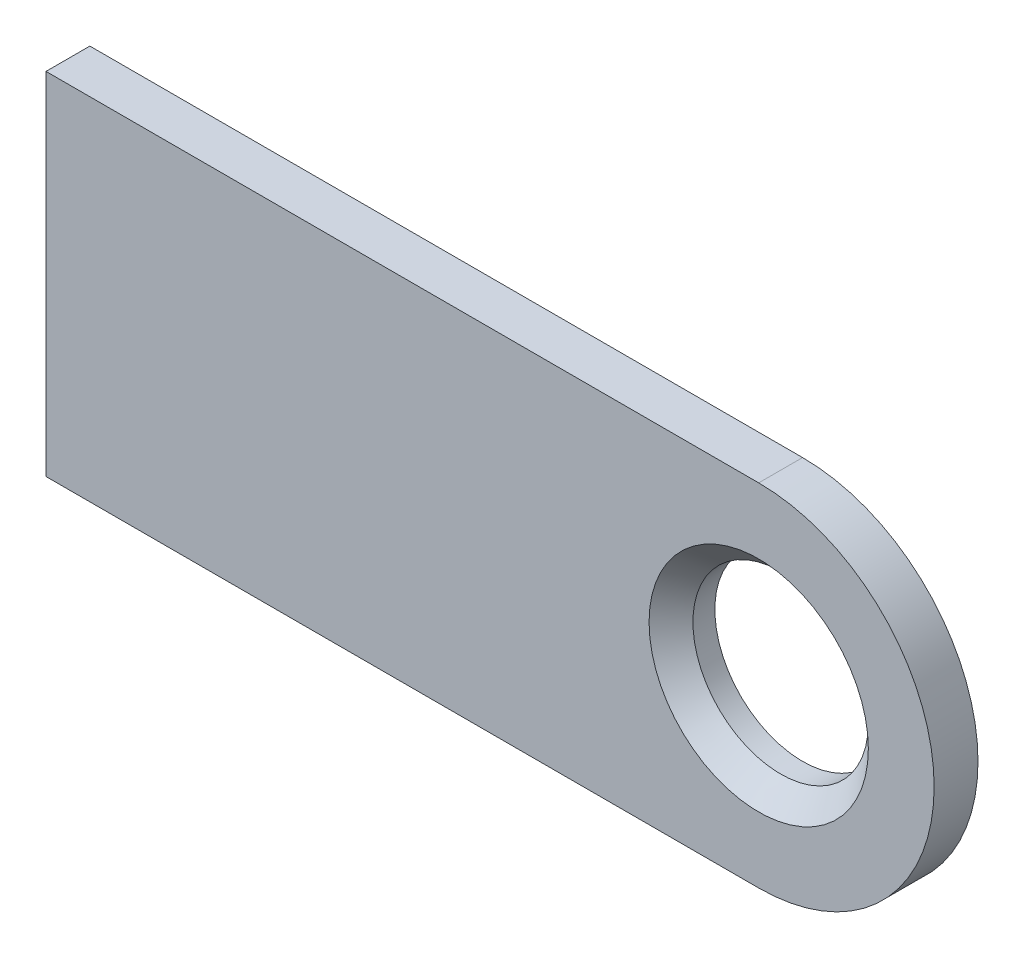
ISO-10303-21;
HEADER;
FILE_DESCRIPTION(('STEP AP214'),'2;1');
FILE_NAME('part.step','',(''),(''),'','','');
FILE_SCHEMA(('AUTOMOTIVE_DESIGN { 1 0 10303 214 1 1 1 1 }'));
ENDSEC;
DATA;
#1=APPLICATION_CONTEXT('core data for automotive mechanical design processes');
#2=APPLICATION_PROTOCOL_DEFINITION('international standard','automotive_design',2000,#1);
#3=PRODUCT_CONTEXT('',#1,'mechanical');
#4=PRODUCT('Part','Part','',(#3));
#5=PRODUCT_RELATED_PRODUCT_CATEGORY('part','',(#4));
#6=PRODUCT_DEFINITION_FORMATION('','',#4);
#7=PRODUCT_DEFINITION_CONTEXT('part definition',#1,'design');
#8=PRODUCT_DEFINITION('design','',#6,#7);
#9=PRODUCT_DEFINITION_SHAPE('','',#8);
#10=(LENGTH_UNIT() NAMED_UNIT(*) SI_UNIT(.MILLI.,.METRE.));
#11=(NAMED_UNIT(*) PLANE_ANGLE_UNIT() SI_UNIT($,.RADIAN.));
#12=(NAMED_UNIT(*) SI_UNIT($,.STERADIAN.) SOLID_ANGLE_UNIT());
#13=UNCERTAINTY_MEASURE_WITH_UNIT(LENGTH_MEASURE(1.E-05),#10,'distance_accuracy_value','');
#14=(GEOMETRIC_REPRESENTATION_CONTEXT(3) GLOBAL_UNCERTAINTY_ASSIGNED_CONTEXT((#13)) GLOBAL_UNIT_ASSIGNED_CONTEXT((#10,
#11,#12)) REPRESENTATION_CONTEXT('',''));
#15=CARTESIAN_POINT('',(0.,0.,0.));
#16=DIRECTION('',(0.,0.,1.));
#17=DIRECTION('',(1.,0.,0.));
#18=AXIS2_PLACEMENT_3D('',#15,#16,#17);
#19=CARTESIAN_POINT('',(0.,0.,4.));
#20=DIRECTION('',(0.,0.,1.));
#21=DIRECTION('',(1.,0.,0.));
#22=AXIS2_PLACEMENT_3D('',#19,#20,#21);
#23=PLANE('',#22);
#24=CARTESIAN_POINT('',(0.,0.,4.));
#25=DIRECTION('',(0.,0.,1.));
#26=DIRECTION('',(1.,0.,0.));
#27=AXIS2_PLACEMENT_3D('',#24,#25,#26);
#28=CIRCLE('',#27,10.);
#29=CARTESIAN_POINT('',(10.,0.,4.));
#30=VERTEX_POINT('',#29);
#31=EDGE_CURVE('E11',#30,#30,#28,.F.);
#32=ORIENTED_EDGE('',*,*,#31,.T.);
#33=EDGE_LOOP('',(#32));
#34=FACE_BOUND('',#33,.T.);
#35=CARTESIAN_POINT('',(0.,0.,4.));
#36=DIRECTION('',(0.,0.,1.));
#37=DIRECTION('',(1.,0.,0.));
#38=AXIS2_PLACEMENT_3D('',#35,#36,#37);
#39=CIRCLE('',#38,16.0000000000001);
#40=CARTESIAN_POINT('',(0.,-16.0000000000003,4.));
#41=VERTEX_POINT('',#40);
#42=CARTESIAN_POINT('',(0.,16.,4.));
#43=VERTEX_POINT('',#42);
#44=EDGE_CURVE('E92',#41,#43,#39,.T.);
#45=ORIENTED_EDGE('',*,*,#44,.T.);
#46=DIRECTION('',(-1.,0.,0.));
#47=VECTOR('',#46,1.);
#48=CARTESIAN_POINT('',(0.,16.,4.));
#49=LINE('',#48,#47);
#50=CARTESIAN_POINT('',(-65.,16.,4.00000000000017));
#51=VERTEX_POINT('',#50);
#52=EDGE_CURVE('E88',#43,#51,#49,.T.);
#53=ORIENTED_EDGE('',*,*,#52,.T.);
#54=DIRECTION('',(0.,-1.,0.));
#55=VECTOR('',#54,1.);
#56=CARTESIAN_POINT('',(-65.,16.,4.00000000000017));
#57=LINE('',#56,#55);
#58=CARTESIAN_POINT('',(-65.0000000000001,-16.0000000000003,4.));
#59=VERTEX_POINT('',#58);
#60=EDGE_CURVE('E90',#51,#59,#57,.T.);
#61=ORIENTED_EDGE('',*,*,#60,.T.);
#62=DIRECTION('',(1.,0.,0.));
#63=VECTOR('',#62,1.);
#64=CARTESIAN_POINT('',(-65.0000000000001,-16.0000000000003,4.));
#65=LINE('',#64,#63);
#66=EDGE_CURVE('E57',#59,#41,#65,.T.);
#67=ORIENTED_EDGE('',*,*,#66,.T.);
#68=EDGE_LOOP('',(#45,#53,#61,#67));
#69=FACE_BOUND('',#68,.T.);
#70=ADVANCED_FACE('F40',(#34,#69),#23,.T.);
#71=CARTESIAN_POINT('',(0.,0.,0.));
#72=DIRECTION('',(0.,0.,1.));
#73=DIRECTION('',(1.,0.,0.));
#74=AXIS2_PLACEMENT_3D('',#71,#72,#73);
#75=PLANE('',#74);
#76=CARTESIAN_POINT('',(0.,0.,0.));
#77=DIRECTION('',(0.,0.,1.));
#78=DIRECTION('',(1.,0.,0.));
#79=AXIS2_PLACEMENT_3D('',#76,#77,#78);
#80=CIRCLE('',#79,16.0000000000001);
#81=CARTESIAN_POINT('',(0.,-16.0000000000003,0.));
#82=VERTEX_POINT('',#81);
#83=CARTESIAN_POINT('',(0.,16.,0.));
#84=VERTEX_POINT('',#83);
#85=EDGE_CURVE('E107',#82,#84,#80,.T.);
#86=ORIENTED_EDGE('',*,*,#85,.F.);
#87=DIRECTION('',(1.,0.,0.));
#88=VECTOR('',#87,1.);
#89=CARTESIAN_POINT('',(-65.,-16.0000000000003,0.));
#90=LINE('',#89,#88);
#91=CARTESIAN_POINT('',(-65.,-16.0000000000003,0.));
#92=VERTEX_POINT('',#91);
#93=EDGE_CURVE('E80',#92,#82,#90,.T.);
#94=ORIENTED_EDGE('',*,*,#93,.F.);
#95=DIRECTION('',(0.,-1.,0.));
#96=VECTOR('',#95,1.);
#97=CARTESIAN_POINT('',(-65.,16.,1.66533453693773E-13));
#98=LINE('',#97,#96);
#99=CARTESIAN_POINT('',(-65.,16.,1.66533453693773E-13));
#100=VERTEX_POINT('',#99);
#101=EDGE_CURVE('E74',#100,#92,#98,.T.);
#102=ORIENTED_EDGE('',*,*,#101,.F.);
#103=DIRECTION('',(-1.,0.,0.));
#104=VECTOR('',#103,1.);
#105=CARTESIAN_POINT('',(0.,16.,0.));
#106=LINE('',#105,#104);
#107=EDGE_CURVE('E97',#84,#100,#106,.T.);
#108=ORIENTED_EDGE('',*,*,#107,.F.);
#109=EDGE_LOOP('',(#86,#94,#102,#108));
#110=FACE_BOUND('',#109,.T.);
#111=CARTESIAN_POINT('',(0.,0.,0.));
#112=DIRECTION('',(0.,0.,1.));
#113=DIRECTION('',(1.,0.,0.));
#114=AXIS2_PLACEMENT_3D('',#111,#112,#113);
#115=CIRCLE('',#114,8.00000000000001);
#116=CARTESIAN_POINT('',(8.00000000000002,0.,0.));
#117=VERTEX_POINT('',#116);
#118=EDGE_CURVE('E110',#117,#117,#115,.T.);
#119=ORIENTED_EDGE('',*,*,#118,.T.);
#120=EDGE_LOOP('',(#119));
#121=FACE_BOUND('',#120,.T.);
#122=ADVANCED_FACE('F131',(#110,#121),#75,.F.);
#123=CARTESIAN_POINT('',(0.,0.,4.));
#124=DIRECTION('',(0.,0.,-1.));
#125=DIRECTION('',(-1.,0.,0.));
#126=AXIS2_PLACEMENT_3D('',#123,#124,#125);
#127=CYLINDRICAL_SURFACE('',#126,16.0000000000001);
#128=ORIENTED_EDGE('',*,*,#85,.T.);
#129=DIRECTION('',(0.,0.,-1.));
#130=VECTOR('',#129,1.);
#131=CARTESIAN_POINT('',(0.,16.,4.));
#132=LINE('',#131,#130);
#133=EDGE_CURVE('E98',#43,#84,#132,.T.);
#134=ORIENTED_EDGE('',*,*,#133,.F.);
#135=ORIENTED_EDGE('',*,*,#44,.F.);
#136=DIRECTION('',(0.,0.,-1.));
#137=VECTOR('',#136,1.);
#138=CARTESIAN_POINT('',(0.,-16.0000000000003,4.));
#139=LINE('',#138,#137);
#140=EDGE_CURVE('E103',#41,#82,#139,.T.);
#141=ORIENTED_EDGE('',*,*,#140,.T.);
#142=EDGE_LOOP('',(#128,#134,#135,#141));
#143=FACE_BOUND('',#142,.T.);
#144=ADVANCED_FACE('F137',(#143),#127,.T.);
#145=CARTESIAN_POINT('',(0.,16.,4.));
#146=DIRECTION('',(0.,-1.,0.));
#147=DIRECTION('',(0.,0.,-1.));
#148=AXIS2_PLACEMENT_3D('',#145,#146,#147);
#149=PLANE('',#148);
#150=ORIENTED_EDGE('',*,*,#107,.T.);
#151=DIRECTION('',(0.,0.,-1.));
#152=VECTOR('',#151,1.);
#153=CARTESIAN_POINT('',(-65.,16.,4.00000000000017));
#154=LINE('',#153,#152);
#155=EDGE_CURVE('E95',#51,#100,#154,.T.);
#156=ORIENTED_EDGE('',*,*,#155,.F.);
#157=ORIENTED_EDGE('',*,*,#52,.F.);
#158=ORIENTED_EDGE('',*,*,#133,.T.);
#159=EDGE_LOOP('',(#150,#156,#157,#158));
#160=FACE_BOUND('',#159,.T.);
#161=ADVANCED_FACE('F96',(#160),#149,.F.);
#162=CARTESIAN_POINT('',(-65.,16.,4.00000000000017));
#163=DIRECTION('',(1.,0.,0.));
#164=DIRECTION('',(0.,0.,-1.));
#165=AXIS2_PLACEMENT_3D('',#162,#163,#164);
#166=PLANE('',#165);
#167=ORIENTED_EDGE('',*,*,#101,.T.);
#168=DIRECTION('',(0.,0.,-1.));
#169=VECTOR('',#168,1.);
#170=CARTESIAN_POINT('',(-65.0000000000001,-16.0000000000003,4.));
#171=LINE('',#170,#169);
#172=EDGE_CURVE('E99',#59,#92,#171,.T.);
#173=ORIENTED_EDGE('',*,*,#172,.F.);
#174=ORIENTED_EDGE('',*,*,#60,.F.);
#175=ORIENTED_EDGE('',*,*,#155,.T.);
#176=EDGE_LOOP('',(#167,#173,#174,#175));
#177=FACE_BOUND('',#176,.T.);
#178=ADVANCED_FACE('F101',(#177),#166,.F.);
#179=CARTESIAN_POINT('',(-65.0000000000001,-16.0000000000003,4.));
#180=DIRECTION('',(0.,1.,0.));
#181=DIRECTION('',(0.,0.,1.));
#182=AXIS2_PLACEMENT_3D('',#179,#180,#181);
#183=PLANE('',#182);
#184=ORIENTED_EDGE('',*,*,#93,.T.);
#185=ORIENTED_EDGE('',*,*,#140,.F.);
#186=ORIENTED_EDGE('',*,*,#66,.F.);
#187=ORIENTED_EDGE('',*,*,#172,.T.);
#188=EDGE_LOOP('',(#184,#185,#186,#187));
#189=FACE_BOUND('',#188,.T.);
#190=ADVANCED_FACE('F127',(#189),#183,.F.);
#191=CARTESIAN_POINT('',(0.,0.,4.));
#192=DIRECTION('',(0.,0.,-1.));
#193=DIRECTION('',(-1.,0.,0.));
#194=AXIS2_PLACEMENT_3D('',#191,#192,#193);
#195=CYLINDRICAL_SURFACE('',#194,8.00000000000001);
#196=CARTESIAN_POINT('',(0.,0.,2.));
#197=DIRECTION('',(0.,0.,1.));
#198=DIRECTION('',(1.,0.,0.));
#199=AXIS2_PLACEMENT_3D('',#196,#197,#198);
#200=CIRCLE('',#199,8.00000000000001);
#201=CARTESIAN_POINT('',(8.00000000000002,0.,2.));
#202=VERTEX_POINT('',#201);
#203=EDGE_CURVE('E49',#202,#202,#200,.T.);
#204=ORIENTED_EDGE('',*,*,#203,.T.);
#205=EDGE_LOOP('',(#204));
#206=FACE_BOUND('',#205,.T.);
#207=ORIENTED_EDGE('',*,*,#118,.F.);
#208=EDGE_LOOP('',(#207));
#209=FACE_BOUND('',#208,.T.);
#210=ADVANCED_FACE('F119',(#206,#209),#195,.F.);
#211=CARTESIAN_POINT('',(0.,0.,2.));
#212=DIRECTION('',(0.,0.,1.));
#213=DIRECTION('',(1.,0.,0.));
#214=AXIS2_PLACEMENT_3D('',#211,#212,#213);
#215=CONICAL_SURFACE('',#214,8.00000000000001,0.785398163397447);
#216=ORIENTED_EDGE('',*,*,#31,.F.);
#217=EDGE_LOOP('',(#216));
#218=FACE_BOUND('',#217,.T.);
#219=ORIENTED_EDGE('',*,*,#203,.F.);
#220=EDGE_LOOP('',(#219));
#221=FACE_BOUND('',#220,.T.);
#222=ADVANCED_FACE('F42',(#218,#221),#215,.F.);
#223=CLOSED_SHELL('',(#70,#122,#144,#161,#178,#190,#210,#222));
#224=MANIFOLD_SOLID_BREP('B2',#223);
#225=ADVANCED_BREP_SHAPE_REPRESENTATION('',(#18,#224),#14);
#226=SHAPE_DEFINITION_REPRESENTATION(#9,#225);
ENDSEC;
END-ISO-10303-21;
